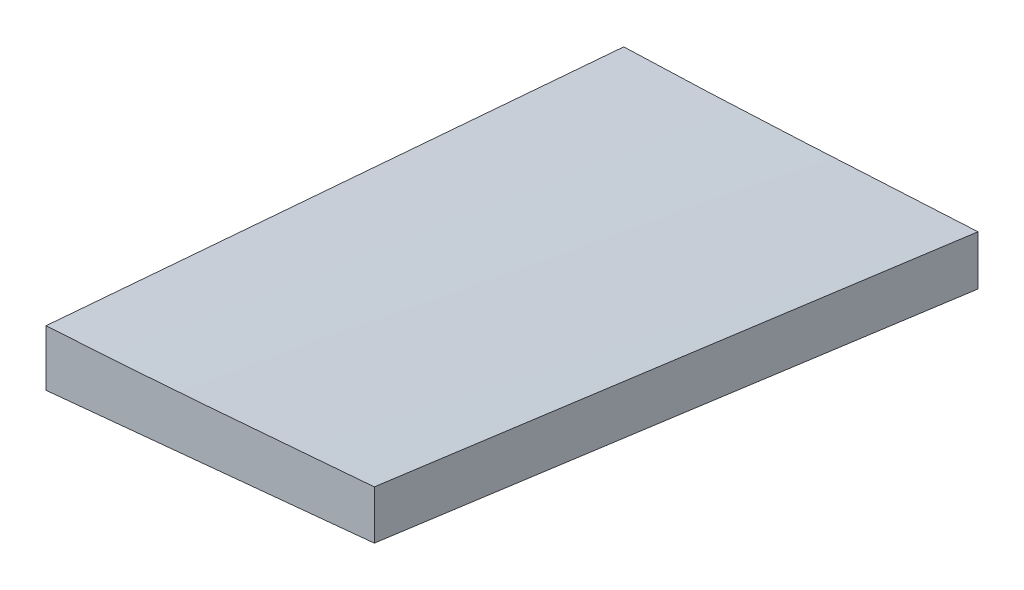
ISO-10303-21;
HEADER;
FILE_DESCRIPTION(('STEP AP214'),'2;1');
FILE_NAME('part.step','',(''),(''),'','','');
FILE_SCHEMA(('AUTOMOTIVE_DESIGN { 1 0 10303 214 1 1 1 1 }'));
ENDSEC;
DATA;
#1=APPLICATION_CONTEXT('core data for automotive mechanical design processes');
#2=APPLICATION_PROTOCOL_DEFINITION('international standard','automotive_design',2000,#1);
#3=PRODUCT_CONTEXT('',#1,'mechanical');
#4=PRODUCT('Part','Part','',(#3));
#5=PRODUCT_RELATED_PRODUCT_CATEGORY('part','',(#4));
#6=PRODUCT_DEFINITION_FORMATION('','',#4);
#7=PRODUCT_DEFINITION_CONTEXT('part definition',#1,'design');
#8=PRODUCT_DEFINITION('design','',#6,#7);
#9=PRODUCT_DEFINITION_SHAPE('','',#8);
#10=(LENGTH_UNIT() NAMED_UNIT(*) SI_UNIT(.MILLI.,.METRE.));
#11=(NAMED_UNIT(*) PLANE_ANGLE_UNIT() SI_UNIT($,.RADIAN.));
#12=(NAMED_UNIT(*) SI_UNIT($,.STERADIAN.) SOLID_ANGLE_UNIT());
#13=UNCERTAINTY_MEASURE_WITH_UNIT(LENGTH_MEASURE(1.E-05),#10,'distance_accuracy_value','');
#14=(GEOMETRIC_REPRESENTATION_CONTEXT(3) GLOBAL_UNCERTAINTY_ASSIGNED_CONTEXT((#13)) GLOBAL_UNIT_ASSIGNED_CONTEXT((#10,
#11,#12)) REPRESENTATION_CONTEXT('',''));
#15=CARTESIAN_POINT('',(0.,0.,0.));
#16=DIRECTION('',(0.,0.,1.));
#17=DIRECTION('',(1.,0.,0.));
#18=AXIS2_PLACEMENT_3D('',#15,#16,#17);
#19=CARTESIAN_POINT('',(122.012987748225,6.34998004884585,335.28));
#20=DIRECTION('',(1.,0.,0.));
#21=DIRECTION('',(0.,1.,0.));
#22=AXIS2_PLACEMENT_3D('',#19,#20,#21);
#23=PLANE('',#22);
#24=CARTESIAN_POINT('',(122.012987748225,-1.74770003692419,619.759999999985));
#25=CARTESIAN_POINT('',(122.012987748225,0.838112262622916,652.992885623925));
#26=CARTESIAN_POINT('',(122.012987748225,3.42334466322475,686.225816353127));
#27=CARTESIAN_POINT('',(122.012987748225,6.3797096216372,724.238201057767));
#28=CARTESIAN_POINT('',(122.012987748225,6.75141008444333,729.017610860847));
#29=CARTESIAN_POINT('',(122.012987748225,7.12309855329968,733.797021596831));
#30=B_SPLINE_CURVE_WITH_KNOTS('',3,(#24,#25,#26,#27,#28,#29),.UNSPECIFIED.,.F.,.F.,(4,2,4),(0.,
100.000000013768,114.381525443931),.UNSPECIFIED.);
#31=CARTESIAN_POINT('',(122.012987748225,-1.74770003692419,619.759999999985));
#32=VERTEX_POINT('',#31);
#33=CARTESIAN_POINT('',(122.012987748225,7.12309855329967,733.797021596831));
#34=VERTEX_POINT('',#33);
#35=EDGE_CURVE('E115',#32,#34,#30,.T.);
#36=ORIENTED_EDGE('',*,*,#35,.T.);
#37=CARTESIAN_POINT('',(122.012987748225,7.12309855329968,733.797021596831));
#38=CARTESIAN_POINT('',(122.012987748225,7.51759526218535,738.497666682933));
#39=CARTESIAN_POINT('',(122.012987748225,7.91297383554846,743.198237426249));
#40=CARTESIAN_POINT('',(122.012987748225,8.70549471122952,752.599230227305));
#41=CARTESIAN_POINT('',(122.012987748225,9.10263701354749,757.299652285046));
#42=CARTESIAN_POINT('',(122.012987748225,9.50066118034288,762.));
#43=B_SPLINE_CURVE_WITH_KNOTS('',3,(#37,#38,#39,#40,#41,#42),.UNSPECIFIED.,.F.,.F.,(4,2,4),(0.,
14.1515089570933,28.3030179141867),.UNSPECIFIED.);
#44=CARTESIAN_POINT('',(122.012987748225,9.50066118034288,762.));
#45=VERTEX_POINT('',#44);
#46=EDGE_CURVE('E120',#34,#45,#43,.T.);
#47=ORIENTED_EDGE('',*,*,#46,.T.);
#48=DIRECTION('',(0.,1.,0.));
#49=VECTOR('',#48,1.);
#50=CARTESIAN_POINT('',(122.012987748225,22.749481355623,762.));
#51=LINE('',#50,#49);
#52=CARTESIAN_POINT('',(122.012986066742,23.2690467874278,762.));
#53=VERTEX_POINT('',#52);
#54=EDGE_CURVE('E118',#45,#53,#51,.T.);
#55=ORIENTED_EDGE('',*,*,#54,.T.);
#56=CARTESIAN_POINT('',(122.012987748225,23.2690175708451,762.));
#57=CARTESIAN_POINT('',(122.012987748225,21.3274646677905,738.29325103234));
#58=CARTESIAN_POINT('',(122.012987748225,19.3854095704972,714.586543215175));
#59=CARTESIAN_POINT('',(122.012987748225,15.5002949874332,667.173209881837));
#60=CARTESIAN_POINT('',(122.012987748225,13.5572355016625,643.466584365663));
#61=CARTESIAN_POINT('',(122.012987748225,11.6136738216531,619.759999999985));
#62=B_SPLINE_CURVE_WITH_KNOTS('',3,(#56,#57,#58,#59,#60,#61),.UNSPECIFIED.,.F.,.F.,(4,2,4),(0.,
71.3583643433903,142.71672868678),.UNSPECIFIED.);
#63=CARTESIAN_POINT('',(122.012987748225,11.6136738216531,619.759999999985));
#64=VERTEX_POINT('',#63);
#65=EDGE_CURVE('E106',#53,#64,#62,.T.);
#66=ORIENTED_EDGE('',*,*,#65,.T.);
#67=DIRECTION('',(0.,1.,0.));
#68=VECTOR('',#67,1.);
#69=CARTESIAN_POINT('',(122.012987748225,6.34998004884585,619.76));
#70=LINE('',#69,#68);
#71=EDGE_CURVE('E11',#32,#64,#70,.T.);
#72=ORIENTED_EDGE('',*,*,#71,.F.);
#73=EDGE_LOOP('',(#36,#47,#55,#66,#72));
#74=FACE_BOUND('',#73,.T.);
#75=ADVANCED_FACE('F44',(#74),#23,.F.);
#76=CARTESIAN_POINT('',(0.,0.,619.76));
#77=DIRECTION('',(0.,0.,-1.));
#78=DIRECTION('',(-1.,0.,0.));
#79=AXIS2_PLACEMENT_3D('',#76,#77,#78);
#80=PLANE('',#79);
#81=DIRECTION('',(1.,0.,0.));
#82=VECTOR('',#81,1.);
#83=CARTESIAN_POINT('',(104.715608500928,-1.74770003692308,619.76));
#84=LINE('',#83,#82);
#85=CARTESIAN_POINT('',(129.715608500912,-1.74770003690514,619.76000000023));
#86=VERTEX_POINT('',#85);
#87=EDGE_CURVE('E177',#32,#86,#84,.T.);
#88=ORIENTED_EDGE('',*,*,#87,.F.);
#89=ORIENTED_EDGE('',*,*,#71,.T.);
#90=CARTESIAN_POINT('',(209.230847335754,15.7935965768529,619.76));
#91=CARTESIAN_POINT('',(207.41455686942,15.6924259805078,619.76));
#92=CARTESIAN_POINT('',(205.59822489933,15.5920060372144,619.76));
#93=CARTESIAN_POINT('',(201.965503035907,15.3922434325193,619.76));
#94=CARTESIAN_POINT('',(200.149113142617,15.2929007703145,619.76));
#95=CARTESIAN_POINT('',(196.516298559292,15.0948685949099,619.76));
#96=CARTESIAN_POINT('',(194.699873869272,14.9961790814402,619.76));
#97=CARTESIAN_POINT('',(191.066983914362,14.799556288656,619.76));
#98=CARTESIAN_POINT('',(189.250518649481,14.7016230091847,619.76));
#99=CARTESIAN_POINT('',(185.617613897391,14.506447661882,619.76));
#100=CARTESIAN_POINT('',(183.801174411456,14.4092055703053,619.76));
#101=CARTESIAN_POINT('',(180.168263251,14.2153050009613,619.76));
#102=CARTESIAN_POINT('',(178.351791576461,14.118646523525,619.76));
#103=CARTESIAN_POINT('',(175.627056123042,13.9741674535704,619.76));
#104=CARTESIAN_POINT('',(174.718805829373,13.9260925123853,619.76));
#105=CARTESIAN_POINT('',(172.902296675919,13.8301047893721,619.76));
#106=CARTESIAN_POINT('',(171.994037816134,13.7821920075444,619.76));
#107=CARTESIAN_POINT('',(169.26922968809,13.6389887519546,619.76));
#108=CARTESIAN_POINT('',(167.452652180701,13.5442335446287,619.76));
#109=CARTESIAN_POINT('',(163.819174875551,13.3571040707853,619.76));
#110=CARTESIAN_POINT('',(162.00227506427,13.2647300658146,619.76));
#111=CARTESIAN_POINT('',(158.368307089354,13.083401958186,619.76));
#112=CARTESIAN_POINT('',(156.551238925987,12.9944478501378,619.76));
#113=CARTESIAN_POINT('',(152.91690965229,12.8207031406438,619.76));
#114=CARTESIAN_POINT('',(151.099648542678,12.7359125241909,619.76));
#115=CARTESIAN_POINT('',(147.464914387711,12.5711121863996,619.76));
#116=CARTESIAN_POINT('',(145.647441343007,12.491102450726,619.76));
#117=CARTESIAN_POINT('',(142.012216761942,12.3364801875576,619.76));
#118=CARTESIAN_POINT('',(140.194465219438,12.2618678043317,619.76));
#119=CARTESIAN_POINT('',(136.55874343715,12.1179672827826,619.76));
#120=CARTESIAN_POINT('',(134.740773196422,12.0486791682962,619.76));
#121=CARTESIAN_POINT('',(131.10461974591,11.9153508402923,619.76));
#122=CARTESIAN_POINT('',(129.286436533956,11.8513106859325,619.76));
#123=CARTESIAN_POINT('',(125.649858896885,11.7285170643905,619.76));
#124=CARTESIAN_POINT('',(123.831464468559,11.6697636922556,619.76));
#125=CARTESIAN_POINT('',(122.012987748173,11.6136738216527,619.76));
#126=B_SPLINE_CURVE_WITH_KNOTS('',3,(#90,#91,#92,#93,#94,#95,#96,#97,#98,#99,#100,#101,#102,
#103,#104,#105,#106,#107,#108,#109,#110,#111,#112,#113,#114,#115,#116,#117,#118,#119,#120,#121,
#122,#123,#124,#125),.UNSPECIFIED.,.F.,.F.,(4,2,2,2,2,2,2,2,2,2,2,2,2,2,2,2,2,4),(0.,
5.45731732806995,10.9146305873691,16.371941591456,21.829251464457,27.2863729411962,
32.7434975130182,35.4720627165319,38.2006279269674,43.6577682906292,49.1155055237518,
54.5732341540616,60.0309431107681,65.4886357019918,70.9464741211801,76.4043369737113,
81.8622613415949,87.3202838140671),.UNSPECIFIED.);
#127=CARTESIAN_POINT('',(209.230847335754,15.7935965768529,619.76));
#128=VERTEX_POINT('',#127);
#129=EDGE_CURVE('E112',#128,#64,#126,.T.);
#130=ORIENTED_EDGE('',*,*,#129,.F.);
#131=DIRECTION('',(0.,1.,0.));
#132=VECTOR('',#131,1.);
#133=CARTESIAN_POINT('',(209.230847335755,-23.8937090007613,619.76));
#134=LINE('',#133,#132);
#135=CARTESIAN_POINT('',(209.230847335754,3.59145350647108,619.76));
#136=VERTEX_POINT('',#135);
#137=EDGE_CURVE('E122',#136,#128,#134,.T.);
#138=ORIENTED_EDGE('',*,*,#137,.F.);
#139=CARTESIAN_POINT('',(129.715608500928,-1.74770003692304,619.76));
#140=CARTESIAN_POINT('',(136.6265871033,-1.28365344115263,619.76));
#141=CARTESIAN_POINT('',(143.537565705671,-0.819606845382206,619.76));
#142=CARTESIAN_POINT('',(157.359522910415,0.108486346158673,619.76));
#143=CARTESIAN_POINT('',(164.270501512787,0.572532941929125,619.76));
#144=CARTESIAN_POINT('',(183.864602522024,1.88820419395677,619.76));
#145=CARTESIAN_POINT('',(196.547724928889,2.73982885021397,619.76));
#146=CARTESIAN_POINT('',(209.230847335754,3.59145350647108,619.76));
#147=B_SPLINE_CURVE_WITH_KNOTS('',3,(#139,#140,#141,#142,#143,#144,#145,#146),.UNSPECIFIED.,.F.,
.F.,(4,2,2,4),(0.,20.7796217571299,41.5592435142597,79.694289428537),.UNSPECIFIED.);
#148=EDGE_CURVE('E187',#86,#136,#147,.T.);
#149=ORIENTED_EDGE('',*,*,#148,.F.);
#150=EDGE_LOOP('',(#88,#89,#130,#138,#149));
#151=FACE_BOUND('',#150,.T.);
#152=ADVANCED_FACE('F180',(#151),#80,.T.);
#153=CARTESIAN_POINT('',(112.535518427817,22.749481355623,762.));
#154=DIRECTION('',(0.,0.,1.));
#155=DIRECTION('',(1.,0.,0.));
#156=AXIS2_PLACEMENT_3D('',#153,#154,#155);
#157=PLANE('',#156);
#158=ORIENTED_EDGE('',*,*,#54,.F.);
#159=DIRECTION('',(0.995347227053735,0.0963529843670705,0.));
#160=VECTOR('',#159,1.);
#161=CARTESIAN_POINT('',(120.108021548784,9.31625399715528,762.));
#162=LINE('',#161,#160);
#163=CARTESIAN_POINT('',(202.839777129521,17.3249682784286,762.));
#164=VERTEX_POINT('',#163);
#165=EDGE_CURVE('E78',#45,#164,#162,.T.);
#166=ORIENTED_EDGE('',*,*,#165,.T.);
#167=DIRECTION('',(0.,1.,0.));
#168=VECTOR('',#167,1.);
#169=CARTESIAN_POINT('',(202.839777129521,29.3249682784286,762.));
#170=LINE('',#169,#168);
#171=CARTESIAN_POINT('',(202.839777129521,29.3249682784286,762.));
#172=VERTEX_POINT('',#171);
#173=EDGE_CURVE('E126',#164,#172,#170,.T.);
#174=ORIENTED_EDGE('',*,*,#173,.T.);
#175=CARTESIAN_POINT('',(202.839777129521,29.3249682784286,762.));
#176=CARTESIAN_POINT('',(200.482600264666,29.1311914896379,762.));
#177=CARTESIAN_POINT('',(190.009434644601,28.2739781180553,762.));
#178=CARTESIAN_POINT('',(171.421660852569,26.7616133091956,762.));
#179=CARTESIAN_POINT('',(147.077039903745,24.8382473853505,762.));
#180=CARTESIAN_POINT('',(122.718950899315,23.2515218880437,762.));
#181=CARTESIAN_POINT('',(102.412508289549,22.2198790300378,762.));
#182=CARTESIAN_POINT('',(86.1658751901163,21.5522919823838,762.));
#183=CARTESIAN_POINT('',(73.9748831889787,21.2819234329439,762.));
#184=CARTESIAN_POINT('',(61.7691681381499,21.3279974820879,762.));
#185=CARTESIAN_POINT('',(51.5952546373882,21.8280413797949,762.));
#186=CARTESIAN_POINT('',(43.4381063789185,22.5738746457633,762.));
#187=CARTESIAN_POINT('',(37.2915954240202,23.5126703877857,762.));
#188=CARTESIAN_POINT('',(32.0787662008837,24.8858383485763,762.));
#189=CARTESIAN_POINT('',(27.6337974107098,26.739509543098,762.));
#190=CARTESIAN_POINT('',(25.1018025837574,29.284196847533,762.));
#191=CARTESIAN_POINT('',(25.0003838385099,30.9705424913396,762.));
#192=CARTESIAN_POINT('',(25.0003838385099,31.0965029420325,762.));
#193=B_SPLINE_CURVE_WITH_KNOTS('',3,(#175,#176,#177,#178,#179,#180,#181,#182,#183,#184,#185,
#186,#187,#188,#189,#190,#191,#192),.UNSPECIFIED.,.F.,.F.,(4,1,1,1,1,1,1,1,1,1,1,1,1,1,1,4),
(0.134203998847545,0.148473300762891,0.197602032937397,0.246719017962397,0.29580544724191,
0.344865124632776,0.369387316655662,0.393904654745514,0.418430229244535,0.443007512255256,
0.455348357344626,0.467804008877276,0.480588405792142,0.487430267088542,0.497580543197764,
0.498396826463848),.UNSPECIFIED.);
#194=EDGE_CURVE('E110',#172,#53,#193,.T.);
#195=ORIENTED_EDGE('',*,*,#194,.T.);
#196=EDGE_LOOP('',(#158,#166,#174,#195));
#197=FACE_BOUND('',#196,.T.);
#198=ADVANCED_FACE('F125',(#197),#157,.T.);
#199=CARTESIAN_POINT('',(222.012987748225,-23.8937090007613,335.28));
#200=DIRECTION('',(0.998992101682105,0.,0.0448863094581294));
#201=DIRECTION('',(0.,1.,0.));
#202=AXIS2_PLACEMENT_3D('',#199,#200,#201);
#203=PLANE('',#202);
#204=CARTESIAN_POINT('',(222.012987748225,-23.8937090007613,335.28));
#205=CARTESIAN_POINT('',(215.621950375233,-10.1464646900732,477.519269261564));
#206=CARTESIAN_POINT('',(209.230888497717,3.59504253956158,619.759083897143));
#207=CARTESIAN_POINT('',(202.839777129521,17.3249682784286,762.));
#208=B_SPLINE_CURVE_WITH_KNOTS('',3,(#204,#205,#206,#207),.UNSPECIFIED.,.F.,.F.,(4,4),(0.,1.),.UNSPECIFIED.);
#209=EDGE_CURVE('E196',#136,#164,#208,.T.);
#210=ORIENTED_EDGE('',*,*,#209,.F.);
#211=ORIENTED_EDGE('',*,*,#137,.T.);
#212=CARTESIAN_POINT('',(222.012987748225,-11.2872773614073,335.28));
#213=CARTESIAN_POINT('',(215.621950375233,2.25782306949605,477.519269261564));
#214=CARTESIAN_POINT('',(209.230888497717,15.7971864193462,619.759083897143));
#215=CARTESIAN_POINT('',(202.839777129521,29.3249682784286,762.));
#216=B_SPLINE_CURVE_WITH_KNOTS('',3,(#212,#213,#214,#215),.UNSPECIFIED.,.F.,.F.,(4,4),(0.,1.),.UNSPECIFIED.);
#217=EDGE_CURVE('E71',#128,#172,#216,.T.);
#218=ORIENTED_EDGE('',*,*,#217,.T.);
#219=ORIENTED_EDGE('',*,*,#173,.F.);
#220=EDGE_LOOP('',(#210,#211,#218,#219));
#221=FACE_BOUND('',#220,.T.);
#222=ADVANCED_FACE('F157',(#221),#203,.T.);
#223=CARTESIAN_POINT('',(222.012987748225,-11.2872773614073,335.28));
#224=CARTESIAN_POINT('',(215.621950375233,2.25782306949605,477.519269261564));
#225=CARTESIAN_POINT('',(209.230888497717,15.7971864193462,619.759083897143));
#226=CARTESIAN_POINT('',(202.839777129521,29.3249682784286,762.));
#227=CARTESIAN_POINT('',(218.569474026706,-11.3263744236417,335.28));
#228=CARTESIAN_POINT('',(212.364886061197,2.15272535408958,477.519269261564));
#229=CARTESIAN_POINT('',(206.160273591164,15.6260880507676,619.759083897143));
#230=CARTESIAN_POINT('',(199.955611630451,29.0878692566778,762.));
#231=CARTESIAN_POINT('',(211.614338336714,-11.4024470677598,335.28));
#232=CARTESIAN_POINT('',(205.825097972641,1.94636141574157,477.519269261565));
#233=CARTESIAN_POINT('',(200.035833104044,15.2894328181897,619.759083897143));
#234=CARTESIAN_POINT('',(194.246518744766,28.62092272987,762.));
#235=CARTESIAN_POINT('',(201.046202820784,-11.5155355801604,335.28));
#236=CARTESIAN_POINT('',(195.960183316022,1.64100708519495,477.519269261564));
#237=CARTESIAN_POINT('',(190.874139306737,14.791812669497,619.759083897143));
#238=CARTESIAN_POINT('',(185.788045806771,27.9310367630314,762.));
#239=CARTESIAN_POINT('',(190.421562401009,-11.6239646215105,335.28));
#240=CARTESIAN_POINT('',(186.071163978279,1.34135026762067,477.519269261564));
#241=CARTESIAN_POINT('',(181.720741051026,14.3009280756986,619.759083897143));
#242=CARTESIAN_POINT('',(177.370268633092,27.2489243930088,761.999999999999));
#243=CARTESIAN_POINT('',(183.356302448994,-11.6915854526342,335.28));
#244=CARTESIAN_POINT('',(179.48576660961,1.1454855942834,477.519269261564));
#245=CARTESIAN_POINT('',(175.615206265701,13.9768195601478,619.759083897143));
#246=CARTESIAN_POINT('',(171.744596431112,26.7965720352444,762.));
#247=CARTESIAN_POINT('',(174.388523129358,-11.7731432923107,335.28));
#248=CARTESIAN_POINT('',(171.103001578197,0.899059371477806,477.519269261564));
#249=CARTESIAN_POINT('',(167.817455522512,13.5655249542131,619.759083897143));
#250=CARTESIAN_POINT('',(164.531859976147,26.2204090461806,762.));
#251=CARTESIAN_POINT('',(163.489709248502,-11.8633262155867,335.28));
#252=CARTESIAN_POINT('',(160.910936734288,0.60773809662375,477.519269261564));
#253=CARTESIAN_POINT('',(158.33213971555,13.073065327781,619.759083897143));
#254=CARTESIAN_POINT('',(155.753293206132,25.5268110681705,761.999999999999));
#255=CARTESIAN_POINT('',(147.154849918996,-11.9140829368556,335.28));
#256=CARTESIAN_POINT('',(145.626036317623,0.251017379627905,477.519269261565));
#257=CARTESIAN_POINT('',(144.097198211725,12.4103806150582,619.759083897144));
#258=CARTESIAN_POINT('',(142.568310615148,24.5581623597207,762.000000000001));
#259=CARTESIAN_POINT('',(133.547087797304,-11.8513571386047,335.28));
#260=CARTESIAN_POINT('',(132.888447204188,0.0521462593199381,477.519269261564));
#261=CARTESIAN_POINT('',(132.229782106547,11.9499125761914,619.759083897143));
#262=CARTESIAN_POINT('',(131.571067518226,23.8360974022951,762.));
#263=CARTESIAN_POINT('',(122.659949238186,-11.7410017797558,335.280000000001));
#264=CARTESIAN_POINT('',(122.697140743006,-0.0501019891075296,477.519269261565));
#265=CARTESIAN_POINT('',(122.734307743302,11.6350607204876,619.759083897143));
#266=CARTESIAN_POINT('',(122.771425252918,23.3086419393149,762.));
#267=CARTESIAN_POINT('',(114.493192339325,-11.6262316691835,335.28));
#268=CARTESIAN_POINT('',(115.052736661929,-0.0970194846432594,477.519269261564));
#269=CARTESIAN_POINT('',(115.612256480008,11.4264556188438,619.759083897143));
#270=CARTESIAN_POINT('',(116.171726807407,22.938349231563,761.999999999999));
#271=CARTESIAN_POINT('',(106.324095444975,-11.4813070111323,335.28));
#272=CARTESIAN_POINT('',(107.407102717467,-0.115334106030914,477.519269261564));
#273=CARTESIAN_POINT('',(108.490085485435,11.2449017180172,619.759083897143));
#274=CARTESIAN_POINT('',(109.573018762723,22.5935560512976,762.));
#275=CARTESIAN_POINT('',(98.1517013141778,-11.3060491598229,335.28));
#276=CARTESIAN_POINT('',(99.7599490935271,-0.105289853007253,477.519269261565));
#277=CARTESIAN_POINT('',(101.368172368352,11.0897323727552,619.759083897144));
#278=CARTESIAN_POINT('',(102.976346152497,22.2731731077499,762.000000000001));
#279=CARTESIAN_POINT('',(89.9750279012389,-11.1021701951475,335.28));
#280=CARTESIAN_POINT('',(92.1109614058318,-0.0686157488297257,477.519269261564));
#281=CARTESIAN_POINT('',(94.2468704059006,10.9592016164349,619.759083897143));
#282=CARTESIAN_POINT('',(96.3827299152893,21.9754374909317,762.));
#283=CARTESIAN_POINT('',(81.7931246917491,-10.8683806880935,335.28));
#284=CARTESIAN_POINT('',(84.4597450626571,-0.00268226262042188,477.519269261565));
#285=CARTESIAN_POINT('',(87.1263409290411,10.8572790817994,619.759083897144));
#286=CARTESIAN_POINT('',(89.7928873047449,21.7056589354515,762.));
#287=CARTESIAN_POINT('',(73.6060212603565,-10.5736728833086,335.279999999999));
#288=CARTESIAN_POINT('',(76.8063043911992,0.122433158677056,477.519269261564));
#289=CARTESIAN_POINT('',(80.0065630175178,10.8128021196095,619.759083897143));
#290=CARTESIAN_POINT('',(83.2067721531562,21.4915895897743,762.));
#291=CARTESIAN_POINT('',(65.4143764421152,-10.1899300133236,335.28));
#292=CARTESIAN_POINT('',(69.1513913096214,0.331870983608891,477.519269261565));
#293=CARTESIAN_POINT('',(72.8883816726035,10.8479348994881,619.759083897144));
#294=CARTESIAN_POINT('',(76.6253225449055,21.3524173245996,762.));
#295=CARTESIAN_POINT('',(57.218819398707,-9.70421420475117,335.28));
#296=CARTESIAN_POINT('',(61.4959487597233,0.637407086376427,477.519269261564));
#297=CARTESIAN_POINT('',(65.7730536162154,10.9732912964508,619.759083897143));
#298=CARTESIAN_POINT('',(70.0501089820274,21.2975940157574,762.));
#299=CARTESIAN_POINT('',(51.753855165005,-9.29406576406763,335.28));
#300=CARTESIAN_POINT('',(56.3933077057463,0.923606423622542,477.519269261564));
#301=CARTESIAN_POINT('',(61.0327357419635,11.1355415302595,619.759083897143));
#302=CARTESIAN_POINT('',(65.6721142875005,21.3358951461287,762.));
#303=CARTESIAN_POINT('',(47.9240317369891,-8.96448844964143,335.28));
#304=CARTESIAN_POINT('',(52.818089020236,1.16404685916252,477.519269261564));
#305=CARTESIAN_POINT('',(57.7121217989589,11.2868450869133,619.759083897143));
#306=CARTESIAN_POINT('',(62.6061050870016,21.3980618238962,762.));
#307=CARTESIAN_POINT('',(45.7218209357501,-8.76534620327357,335.28));
#308=CARTESIAN_POINT('',(50.7660285067419,1.3113655323144,477.519269261564));
#309=CARTESIAN_POINT('',(55.8102115732095,11.3823401868492,619.759083897143));
#310=CARTESIAN_POINT('',(60.8543451489969,21.4417333506161,762.));
#311=CARTESIAN_POINT('',(42.4027754578273,-8.432707682147,335.280000000001));
#312=CARTESIAN_POINT('',(47.6828454316512,1.56346050757602,477.519269261565));
#313=CARTESIAN_POINT('',(52.9628909009511,11.5538916162458,619.759083897144));
#314=CARTESIAN_POINT('',(58.2428868795708,21.5327412341478,762.000000000001));
#315=CARTESIAN_POINT('',(39.0713826541202,-8.06384555902649,335.279999999999));
#316=CARTESIAN_POINT('',(44.5960375014028,1.84855027043535,477.519269261564));
#317=CARTESIAN_POINT('',(50.1206678441612,11.755209018844,619.759083897142));
#318=CARTESIAN_POINT('',(55.6452486962394,21.6502862764848,761.999999999999));
#319=CARTESIAN_POINT('',(35.7310935187291,-7.65734912890353,335.28));
#320=CARTESIAN_POINT('',(41.5071383578781,2.1677625802585,477.519269261565));
#321=CARTESIAN_POINT('',(47.283158692503,11.9871372083673,619.759083897144));
#322=CARTESIAN_POINT('',(53.0591295364477,21.7949303457084,762.000000000001));
#323=CARTESIAN_POINT('',(32.3856911285866,-7.21086412592674,335.28));
#324=CARTESIAN_POINT('',(38.4179939023169,2.52333107982961,477.519269261564));
#325=CARTESIAN_POINT('',(44.4502721715231,12.2517892045327,619.759083897143));
#326=CARTESIAN_POINT('',(50.4825009500491,21.9686658384681,761.999999999999));
#327=CARTESIAN_POINT('',(29.0388190535993,-6.72415739916843,335.28));
#328=CARTESIAN_POINT('',(35.3303071809232,2.91510782511942,477.519269261565));
#329=CARTESIAN_POINT('',(41.621770803723,12.5486359683541,619.759083897143));
#330=CARTESIAN_POINT('',(47.9131849358426,22.1705826208209,762.));
#331=CARTESIAN_POINT('',(25.6949743291155,-6.19196852419016,335.28));
#332=CARTESIAN_POINT('',(32.2467004538082,3.35008801111173,477.519269261565));
#333=CARTESIAN_POINT('',(38.7984020739767,12.8864074653604,619.759083897144));
#334=CARTESIAN_POINT('',(45.3500542034651,22.4111454288413,762.000000000001));
#335=CARTESIAN_POINT('',(22.9174344404017,-5.69180499526552,335.28));
#336=CARTESIAN_POINT('',(29.6847215388951,3.76530583704974,477.519269261564));
#337=CARTESIAN_POINT('',(36.4519841328644,13.2166795883118,619.759083897143));
#338=CARTESIAN_POINT('',(43.2191972361536,22.656471848806,761.999999999999));
#339=CARTESIAN_POINT('',(20.7051166447645,-5.24830690376412,335.28));
#340=CARTESIAN_POINT('',(27.6427855448402,4.13795801459049,477.519269261564));
#341=CARTESIAN_POINT('',(34.5804299403918,13.5184858518919,619.759083897144));
#342=CARTESIAN_POINT('',(41.5180248452633,22.8874321984255,762.));
#343=CARTESIAN_POINT('',(19.0522311011638,-4.89036823785229,335.28));
#344=CARTESIAN_POINT('',(26.1162869738974,4.44099244551772,477.519269261565));
#345=CARTESIAN_POINT('',(33.1803183421069,13.7666160478345,619.759083897144));
#346=CARTESIAN_POINT('',(40.2443002196361,23.0806581593835,762.000000000001));
#347=CARTESIAN_POINT('',(17.4072680026639,-4.50393109256964,335.28));
#348=CARTESIAN_POINT('',(24.5959209475556,4.77057979291317,477.519269261564));
#349=CARTESIAN_POINT('',(31.7845493879232,14.0393535973428,619.759083897143));
#350=CARTESIAN_POINT('',(38.9731283376106,23.2965459110046,761.999999999999));
#351=CARTESIAN_POINT('',(15.7719559277294,-4.08585733946278,335.279999999999));
#352=CARTESIAN_POINT('',(23.0830306833606,5.12953181584458,477.519269261564));
#353=CARTESIAN_POINT('',(30.3940809344676,14.3391838900987,619.759083897143));
#354=CARTESIAN_POINT('',(37.7050816948944,23.5372544735851,762.));
#355=CARTESIAN_POINT('',(14.1482110615158,-3.63320964201411,335.28));
#356=CARTESIAN_POINT('',(21.5791210658283,5.52064217750062,477.519269261565));
#357=CARTESIAN_POINT('',(29.0100065656166,14.6687569159621,619.759083897144));
#358=CARTESIAN_POINT('',(36.4408425747248,23.8052901636559,762.));
#359=CARTESIAN_POINT('',(12.5379887560416,-3.14346189168235,335.28));
#360=CARTESIAN_POINT('',(20.0857854765168,5.94643031634065,477.519269261564));
#361=CARTESIAN_POINT('',(27.6335576924679,15.0305854433104,619.759083897143));
#362=CARTESIAN_POINT('',(35.1812804177387,24.1031590795125,762.));
#363=CARTESIAN_POINT('',(10.9443022314088,-2.61171665583038,335.28));
#364=CARTESIAN_POINT('',(18.6055358798854,6.41151219142834,477.519269261564));
#365=CARTESIAN_POINT('',(26.2667450238378,15.4290039576339,619.759083897143));
#366=CARTESIAN_POINT('',(33.92790467711,24.4349142330716,762.));
#367=CARTESIAN_POINT('',(9.3696983908296,-2.03559280479495,335.28));
#368=CARTESIAN_POINT('',(17.140516523627,6.9183980534325,477.519269261565));
#369=CARTESIAN_POINT('',(24.9113101519002,15.8666518306067,619.759083897144));
#370=CARTESIAN_POINT('',(32.6820542894933,24.8033241170132,762.));
#371=CARTESIAN_POINT('',(7.81930606312509,-1.40676584170021,335.28));
#372=CARTESIAN_POINT('',(15.6951423376886,7.47472087107555,477.519269261564));
#373=CARTESIAN_POINT('',(23.5709541077281,16.3504705027981,619.759083897143));
#374=CARTESIAN_POINT('',(31.4467163870874,25.2146386437529,761.999999999999));
#375=CARTESIAN_POINT('',(6.2945427283012,-0.728623104338553,335.28));
#376=CARTESIAN_POINT('',(14.270722157368,8.07829784576766,477.519269261565));
#377=CARTESIAN_POINT('',(22.2468770819107,16.8794817148207,619.759083897144));
#378=CARTESIAN_POINT('',(30.2229825157733,25.6690840931059,762.000000000001));
#379=CARTESIAN_POINT('',(4.81910701938389,0.0452105722964347,335.28));
#380=CARTESIAN_POINT('',(12.8897475080532,8.77532558765721,477.519269261564));
#381=CARTESIAN_POINT('',(20.9603634921985,17.4997035219648,619.759083897142));
#382=CARTESIAN_POINT('',(29.0309299856635,26.2124999655045,761.999999999998));
#383=CARTESIAN_POINT('',(3.44019696912771,0.973032127436344,335.28));
#384=CARTESIAN_POINT('',(11.5941800006254,9.61860132023108,477.519269261566));
#385=CARTESIAN_POINT('',(19.748138527599,18.2584334319726,619.759083897145));
#386=CARTESIAN_POINT('',(27.9020475638924,26.8866840529463,762.000000000003));
#387=CARTESIAN_POINT('',(2.18607039010745,2.05737434257256,335.28));
#388=CARTESIAN_POINT('',(10.4107564395223,10.6111710650528,477.519269261563));
#389=CARTESIAN_POINT('',(18.6354179844131,19.1592307064798,619.759083897141));
#390=CARTESIAN_POINT('',(26.8600300386238,27.6957088571391,761.999999999997));
#391=CARTESIAN_POINT('',(1.27839650729546,3.09358418996593,335.28));
#392=CARTESIAN_POINT('',(9.54912891024288,11.5662188458673,477.519269261565));
#393=CARTESIAN_POINT('',(17.8198368086662,20.0331164207154,619.759083897144));
#394=CARTESIAN_POINT('',(26.0904952164094,28.4884325047958,762.000000000001));
#395=CARTESIAN_POINT('',(0.675104053522571,4.01206497822802,335.28));
#396=CARTESIAN_POINT('',(8.9756319822023,12.418850021307,477.519269261564));
#397=CARTESIAN_POINT('',(17.2761354063579,20.8198979833327,619.759083897143));
#398=CARTESIAN_POINT('',(25.5765893398334,29.2093644545907,761.999999999999));
#399=CARTESIAN_POINT('',(0.311283524258083,4.74838484159257,335.28));
#400=CARTESIAN_POINT('',(8.62885568345465,13.1054382128106,477.519269261565));
#401=CARTESIAN_POINT('',(16.9464033381271,21.4567545029755,619.759083897144));
#402=CARTESIAN_POINT('',(25.2639015021194,29.7964893023725,762.));
#403=CARTESIAN_POINT('',(0.0633372908855968,5.53486679411943,335.28));
#404=CARTESIAN_POINT('',(8.3922174754818,13.8408332089873,477.519269261564));
#405=CARTESIAN_POINT('',(16.7210731555539,22.141062542802,619.759083897143));
#406=CARTESIAN_POINT('',(25.0498793449458,30.4297103858489,761.999999999999));
#407=CARTESIAN_POINT('',(9.29076906829817E-07,6.07768392100159,335.28));
#408=CARTESIAN_POINT('',(8.3334947321307,14.3508356613562,477.519269261564));
#409=CARTESIAN_POINT('',(16.6669640306604,22.6182503206576,619.759083897143));
#410=CARTESIAN_POINT('',(25.0003838385099,30.8740834891911,762.));
#411=CARTESIAN_POINT('',(9.29077044083409E-07,6.34998004884586,335.28));
#412=CARTESIAN_POINT('',(8.33349473213078,14.6065062308661,477.519269261564));
#413=CARTESIAN_POINT('',(16.6669640306604,22.8572953318332,619.759083897143));
#414=CARTESIAN_POINT('',(25.0003838385099,31.0965029420325,762.));
#415=B_SPLINE_SURFACE_WITH_KNOTS('',3,3,((#223,#224,#225,#226),(#227,#228,#229,#230),(#231,#232,
#233,#234),(#235,#236,#237,#238),(#239,#240,#241,#242),(#243,#244,#245,#246),(#247,#248,#249,
#250),(#251,#252,#253,#254),(#255,#256,#257,#258),(#259,#260,#261,#262),(#263,#264,#265,#266),
(#267,#268,#269,#270),(#271,#272,#273,#274),(#275,#276,#277,#278),(#279,#280,#281,#282),(#283,
#284,#285,#286),(#287,#288,#289,#290),(#291,#292,#293,#294),(#295,#296,#297,#298),(#299,#300,
#301,#302),(#303,#304,#305,#306),(#307,#308,#309,#310),(#311,#312,#313,#314),(#315,#316,#317,
#318),(#319,#320,#321,#322),(#323,#324,#325,#326),(#327,#328,#329,#330),(#331,#332,#333,#334),
(#335,#336,#337,#338),(#339,#340,#341,#342),(#343,#344,#345,#346),(#347,#348,#349,#350),(#351,
#352,#353,#354),(#355,#356,#357,#358),(#359,#360,#361,#362),(#363,#364,#365,#366),(#367,#368,
#369,#370),(#371,#372,#373,#374),(#375,#376,#377,#378),(#379,#380,#381,#382),(#383,#384,#385,
#386),(#387,#388,#389,#390),(#391,#392,#393,#394),(#395,#396,#397,#398),(#399,#400,#401,#402),
(#403,#404,#405,#406),(#407,#408,#409,#410),(#411,#412,#413,#414)),.UNSPECIFIED.,.F.,.F.,.F.,(4,
1,1,1,2,1,1,1,1,1,1,1,1,1,1,1,1,2,1,1,1,1,1,1,1,1,1,1,1,1,1,1,1,1,1,1,1,1,1,1,1,1,1,4),(4,4),
(0.,0.0210721432720827,0.0421442865441653,0.063216429816248,0.0842885730883306,
0.116982404956549,0.149676236824766,0.182370068692984,0.198716984627093,0.215063900561202,
0.231410816495311,0.24775773242942,0.264104648363529,0.280451564297638,0.296798480231747,
0.313145396165856,0.329492312099965,0.345839228034074,0.352409679753848,0.358980131473621,
0.365550583193395,0.372121034913169,0.378691486632943,0.385261938352717,0.39183239007249,
0.398402841792264,0.401688067652151,0.404973293512038,0.408258519371925,0.411543745231812,
0.414828971091699,0.418114196951585,0.421399422811472,0.424684648671359,0.427969874531246,
0.431255100391133,0.43454032625102,0.437825552110907,0.441110777970794,0.444396003830681,
0.446038616760624,0.447681229690568,0.449323842620511,0.450966455550454),(0.,1.),.UNSPECIFIED.);
#416=ORIENTED_EDGE('',*,*,#217,.F.);
#417=ORIENTED_EDGE('',*,*,#129,.T.);
#418=ORIENTED_EDGE('',*,*,#65,.F.);
#419=ORIENTED_EDGE('',*,*,#194,.F.);
#420=EDGE_LOOP('',(#416,#417,#418,#419));
#421=FACE_BOUND('',#420,.T.);
#422=ADVANCED_FACE('F108',(#421),#415,.T.);
#423=CARTESIAN_POINT('',(148.93082104307,-23.8937090007613,335.28));
#424=CARTESIAN_POINT('',(139.323254044884,-12.8160361171643,477.519269261564));
#425=CARTESIAN_POINT('',(129.715662542174,-1.74410031462064,619.759083897143));
#426=CARTESIAN_POINT('',(120.108021548784,9.31625399715528,762.));
#427=CARTESIAN_POINT('',(155.021001601833,-23.8937090007613,335.28));
#428=CARTESIAN_POINT('',(145.68147873908,-12.5935718315734,477.519269261564));
#429=CARTESIAN_POINT('',(136.341931371802,-1.29917174343879,619.759083897143));
#430=CARTESIAN_POINT('',(127.002334513845,9.98364685392806,762.));
#431=CARTESIAN_POINT('',(167.201362719359,-23.8937090007613,335.28));
#432=CARTESIAN_POINT('',(158.397928127471,-12.1486432603916,477.519269261565));
#433=CARTESIAN_POINT('',(149.59446903106,-0.409314601075073,619.759083897144));
#434=CARTESIAN_POINT('',(140.790960443968,11.3184325674736,762.));
#435=CARTESIAN_POINT('',(185.471904395647,-23.8937090007613,335.28));
#436=CARTESIAN_POINT('',(177.472602210058,-11.4812504036188,477.519269261564));
#437=CARTESIAN_POINT('',(169.473275519945,0.925471112470457,619.759083897143));
#438=CARTESIAN_POINT('',(161.473899339152,13.3206111377919,762.));
#439=CARTESIAN_POINT('',(203.742446071936,-23.8937090007613,335.28));
#440=CARTESIAN_POINT('',(196.547276292646,-10.813857546846,477.519269261564));
#441=CARTESIAN_POINT('',(189.352082008831,2.26025682601603,619.759083897143));
#442=CARTESIAN_POINT('',(182.156838234336,15.3227897081103,761.999999999999));
#443=CARTESIAN_POINT('',(215.922807189462,-23.8937090007613,335.28));
#444=CARTESIAN_POINT('',(209.263725681037,-10.3689289756642,477.519269261564));
#445=CARTESIAN_POINT('',(202.604619668088,3.15011396837973,619.759083897143));
#446=CARTESIAN_POINT('',(195.945464164459,16.6575754216558,762.));
#447=CARTESIAN_POINT('',(222.012987748225,-23.8937090007613,335.28));
#448=CARTESIAN_POINT('',(215.621950375233,-10.1464646900732,477.519269261564));
#449=CARTESIAN_POINT('',(209.230888497717,3.59504253956158,619.759083897143));
#450=CARTESIAN_POINT('',(202.839777129521,17.3249682784286,762.));
#451=B_SPLINE_SURFACE_WITH_KNOTS('',3,3,((#423,#424,#425,#426),(#427,#428,#429,#430),(#431,#432,
#433,#434),(#435,#436,#437,#438),(#439,#440,#441,#442),(#443,#444,#445,#446),(#447,#448,#449,
#450)),.UNSPECIFIED.,.F.,.F.,.F.,(4,1,1,1,4),(4,4),(0.796773836641175,0.840719353183708,
0.884664869726241,0.928610386268774,0.972555902811307),(0.,1.),.UNSPECIFIED.);
#452=CARTESIAN_POINT('',(148.93082104307,-23.8937090007613,335.28));
#453=CARTESIAN_POINT('',(139.323254044884,-12.8160361171643,477.519269261564));
#454=CARTESIAN_POINT('',(129.715662542174,-1.74410031462064,619.759083897143));
#455=CARTESIAN_POINT('',(120.108021548784,9.31625399715528,762.));
#456=B_SPLINE_CURVE_WITH_KNOTS('',3,(#452,#453,#454,#455),.UNSPECIFIED.,.F.,.F.,(4,4),(0.,1.),.UNSPECIFIED.);
#457=EDGE_CURVE('E63',#86,#34,#456,.T.);
#458=ORIENTED_EDGE('',*,*,#457,.F.);
#459=ORIENTED_EDGE('',*,*,#148,.T.);
#460=ORIENTED_EDGE('',*,*,#209,.T.);
#461=ORIENTED_EDGE('',*,*,#165,.F.);
#462=ORIENTED_EDGE('',*,*,#46,.F.);
#463=EDGE_LOOP('',(#458,#459,#460,#461,#462));
#464=FACE_BOUND('',#463,.T.);
#465=ADVANCED_FACE('F156',(#464),#451,.T.);
#466=CARTESIAN_POINT('',(98.93082104307,-23.8937090007613,335.28));
#467=CARTESIAN_POINT('',(89.323254044884,-12.8160361171643,477.519269261564));
#468=CARTESIAN_POINT('',(79.7156625421738,-1.74410031462064,619.759083897143));
#469=CARTESIAN_POINT('',(70.1080215487835,9.31625399715528,762.));
#470=CARTESIAN_POINT('',(103.097487709737,-23.8937090007613,335.28));
#471=CARTESIAN_POINT('',(93.4899207115506,-12.8160361171643,477.519269261564));
#472=CARTESIAN_POINT('',(83.8823292088405,-1.74410031462064,619.759083897143));
#473=CARTESIAN_POINT('',(74.2746882154502,9.31625399715528,762.));
#474=CARTESIAN_POINT('',(111.43082104307,-23.8937090007613,335.28));
#475=CARTESIAN_POINT('',(101.823254044884,-12.8160361171643,477.519269261564));
#476=CARTESIAN_POINT('',(92.2156625421738,-1.74410031462064,619.759083897143));
#477=CARTESIAN_POINT('',(82.6080215487835,9.31625399715527,762.));
#478=CARTESIAN_POINT('',(123.93082104307,-23.8937090007613,335.280000000001));
#479=CARTESIAN_POINT('',(114.323254044884,-12.8160361171644,477.519269261565));
#480=CARTESIAN_POINT('',(104.715662542174,-1.74410031462064,619.759083897144));
#481=CARTESIAN_POINT('',(95.1080215487836,9.3162539971553,762.000000000001));
#482=CARTESIAN_POINT('',(136.43082104307,-23.8937090007613,335.279999999999));
#483=CARTESIAN_POINT('',(126.823254044884,-12.8160361171643,477.519269261564));
#484=CARTESIAN_POINT('',(117.215662542174,-1.74410031462065,619.759083897143));
#485=CARTESIAN_POINT('',(107.608021548783,9.31625399715526,761.999999999999));
#486=CARTESIAN_POINT('',(144.764154376403,-23.8937090007613,335.28));
#487=CARTESIAN_POINT('',(135.156587378217,-12.8160361171643,477.519269261564));
#488=CARTESIAN_POINT('',(125.548995875507,-1.74410031462064,619.759083897143));
#489=CARTESIAN_POINT('',(115.941354882117,9.31625399715528,762.));
#490=CARTESIAN_POINT('',(148.93082104307,-23.8937090007613,335.28));
#491=CARTESIAN_POINT('',(139.323254044884,-12.8160361171643,477.519269261564));
#492=CARTESIAN_POINT('',(129.715662542174,-1.74410031462064,619.759083897143));
#493=CARTESIAN_POINT('',(120.108021548784,9.31625399715528,762.));
#494=B_SPLINE_SURFACE_WITH_KNOTS('',3,3,((#466,#467,#468,#469),(#470,#471,#472,#473),(#474,#475,
#476,#477),(#478,#479,#480,#481),(#482,#483,#484,#485),(#486,#487,#488,#489),(#490,#491,#492,
#493)),.UNSPECIFIED.,.F.,.F.,.F.,(4,1,1,1,4),(4,4),(0.684963327266946,0.712915954610504,
0.740868581954061,0.768821209297618,0.796773836641175),(0.,1.),.UNSPECIFIED.);
#495=ORIENTED_EDGE('',*,*,#35,.F.);
#496=ORIENTED_EDGE('',*,*,#87,.T.);
#497=ORIENTED_EDGE('',*,*,#457,.T.);
#498=EDGE_LOOP('',(#495,#496,#497));
#499=FACE_BOUND('',#498,.T.);
#500=ADVANCED_FACE('F46',(#499),#494,.T.);
#501=CLOSED_SHELL('',(#75,#152,#198,#222,#422,#465,#500));
#502=MANIFOLD_SOLID_BREP('B2',#501);
#503=ADVANCED_BREP_SHAPE_REPRESENTATION('',(#18,#502),#14);
#504=SHAPE_DEFINITION_REPRESENTATION(#9,#503);
ENDSEC;
END-ISO-10303-21;
